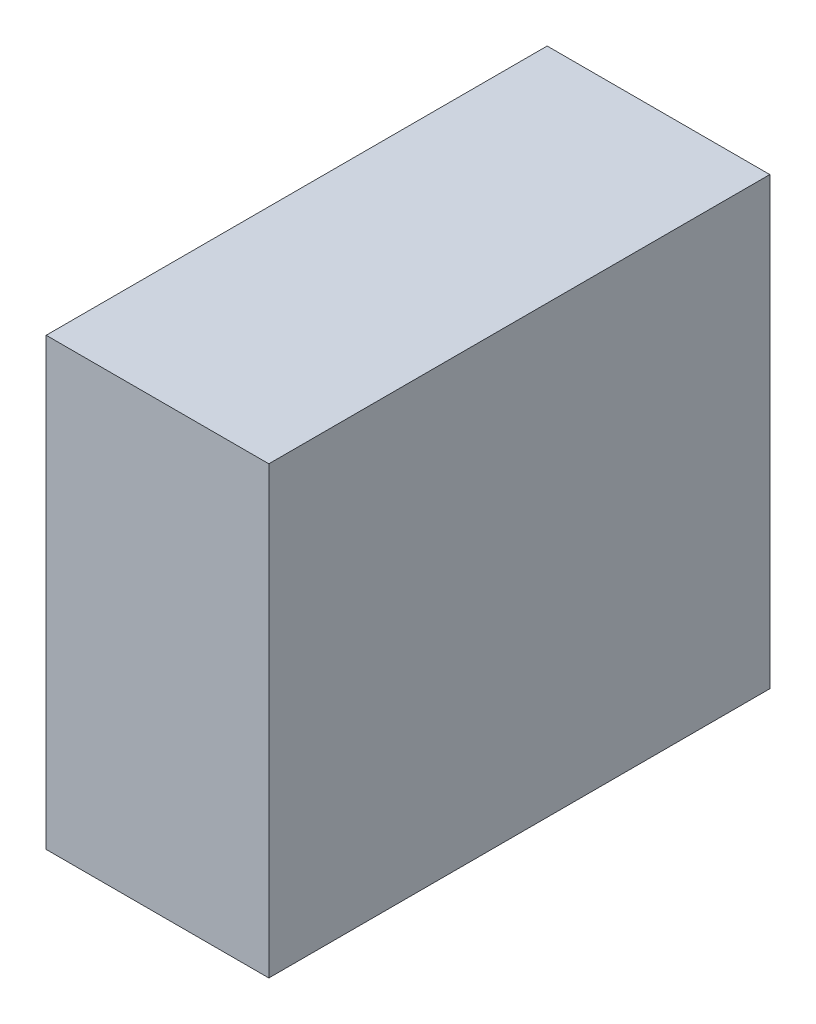
ISO-10303-21;
HEADER;
FILE_DESCRIPTION(('STEP AP214'),'2;1');
FILE_NAME('part.step','',(''),(''),'','','');
FILE_SCHEMA(('AUTOMOTIVE_DESIGN { 1 0 10303 214 1 1 1 1 }'));
ENDSEC;
DATA;
#1=APPLICATION_CONTEXT('core data for automotive mechanical design processes');
#2=APPLICATION_PROTOCOL_DEFINITION('international standard','automotive_design',2000,#1);
#3=PRODUCT_CONTEXT('',#1,'mechanical');
#4=PRODUCT('Part','Part','',(#3));
#5=PRODUCT_RELATED_PRODUCT_CATEGORY('part','',(#4));
#6=PRODUCT_DEFINITION_FORMATION('','',#4);
#7=PRODUCT_DEFINITION_CONTEXT('part definition',#1,'design');
#8=PRODUCT_DEFINITION('design','',#6,#7);
#9=PRODUCT_DEFINITION_SHAPE('','',#8);
#10=(LENGTH_UNIT() NAMED_UNIT(*) SI_UNIT(.MILLI.,.METRE.));
#11=(NAMED_UNIT(*) PLANE_ANGLE_UNIT() SI_UNIT($,.RADIAN.));
#12=(NAMED_UNIT(*) SI_UNIT($,.STERADIAN.) SOLID_ANGLE_UNIT());
#13=UNCERTAINTY_MEASURE_WITH_UNIT(LENGTH_MEASURE(1.E-05),#10,'distance_accuracy_value','');
#14=(GEOMETRIC_REPRESENTATION_CONTEXT(3) GLOBAL_UNCERTAINTY_ASSIGNED_CONTEXT((#13)) GLOBAL_UNIT_ASSIGNED_CONTEXT((#10,
#11,#12)) REPRESENTATION_CONTEXT('',''));
#15=CARTESIAN_POINT('',(0.,0.,0.));
#16=DIRECTION('',(0.,0.,1.));
#17=DIRECTION('',(1.,0.,0.));
#18=AXIS2_PLACEMENT_3D('',#15,#16,#17);
#19=CARTESIAN_POINT('',(0.1999996,-0.3999992,0.));
#20=DIRECTION('',(-1.,0.,0.));
#21=DIRECTION('',(0.,0.,1.));
#22=AXIS2_PLACEMENT_3D('',#19,#20,#21);
#23=PLANE('',#22);
#24=DIRECTION('',(0.,0.,-1.));
#25=VECTOR('',#24,1.);
#26=CARTESIAN_POINT('',(0.1999996,0.3999992,0.));
#27=LINE('',#26,#25);
#28=CARTESIAN_POINT('',(0.1999996,0.3999992,0.));
#29=VERTEX_POINT('',#28);
#30=CARTESIAN_POINT('',(0.1999996,0.3999992,0.90000074));
#31=VERTEX_POINT('',#30);
#32=EDGE_CURVE('E20',#29,#31,#27,.F.);
#33=ORIENTED_EDGE('',*,*,#32,.T.);
#34=DIRECTION('',(0.,1.,0.));
#35=VECTOR('',#34,1.);
#36=CARTESIAN_POINT('',(0.1999996,0.3999992,0.90000074));
#37=LINE('',#36,#35);
#38=CARTESIAN_POINT('',(0.1999996,-0.3999992,0.90000074));
#39=VERTEX_POINT('',#38);
#40=EDGE_CURVE('E55',#31,#39,#37,.F.);
#41=ORIENTED_EDGE('',*,*,#40,.T.);
#42=DIRECTION('',(0.,0.,1.));
#43=VECTOR('',#42,1.);
#44=CARTESIAN_POINT('',(0.1999996,-0.3999992,0.));
#45=LINE('',#44,#43);
#46=CARTESIAN_POINT('',(0.1999996,-0.3999992,0.));
#47=VERTEX_POINT('',#46);
#48=EDGE_CURVE('E76',#39,#47,#45,.F.);
#49=ORIENTED_EDGE('',*,*,#48,.T.);
#50=DIRECTION('',(0.,1.,0.));
#51=VECTOR('',#50,1.);
#52=CARTESIAN_POINT('',(0.1999996,0.3999992,0.));
#53=LINE('',#52,#51);
#54=EDGE_CURVE('E58',#29,#47,#53,.F.);
#55=ORIENTED_EDGE('',*,*,#54,.F.);
#56=EDGE_LOOP('',(#33,#41,#49,#55));
#57=FACE_BOUND('',#56,.T.);
#58=ADVANCED_FACE('F17',(#57),#23,.F.);
#59=CARTESIAN_POINT('',(0.1999996,0.3999992,0.));
#60=DIRECTION('',(0.,-1.,0.));
#61=DIRECTION('',(0.,0.,-1.));
#62=AXIS2_PLACEMENT_3D('',#59,#60,#61);
#63=PLANE('',#62);
#64=DIRECTION('',(0.,0.,-1.));
#65=VECTOR('',#64,1.);
#66=CARTESIAN_POINT('',(-0.1999996,0.3999992,0.));
#67=LINE('',#66,#65);
#68=CARTESIAN_POINT('',(-0.1999996,0.3999992,0.));
#69=VERTEX_POINT('',#68);
#70=CARTESIAN_POINT('',(-0.1999996,0.3999992,0.90000074));
#71=VERTEX_POINT('',#70);
#72=EDGE_CURVE('E73',#69,#71,#67,.F.);
#73=ORIENTED_EDGE('',*,*,#72,.T.);
#74=DIRECTION('',(-1.,0.,0.));
#75=VECTOR('',#74,1.);
#76=CARTESIAN_POINT('',(-0.1999996,0.3999992,0.90000074));
#77=LINE('',#76,#75);
#78=EDGE_CURVE('E63',#71,#31,#77,.F.);
#79=ORIENTED_EDGE('',*,*,#78,.T.);
#80=ORIENTED_EDGE('',*,*,#32,.F.);
#81=DIRECTION('',(-1.,0.,0.));
#82=VECTOR('',#81,1.);
#83=CARTESIAN_POINT('',(-0.1999996,0.3999992,0.));
#84=LINE('',#83,#82);
#85=EDGE_CURVE('E78',#69,#29,#84,.F.);
#86=ORIENTED_EDGE('',*,*,#85,.F.);
#87=EDGE_LOOP('',(#73,#79,#80,#86));
#88=FACE_BOUND('',#87,.T.);
#89=ADVANCED_FACE('F72',(#88),#63,.F.);
#90=CARTESIAN_POINT('',(-0.1999996,0.3999992,0.90000074));
#91=DIRECTION('',(0.,0.,-1.));
#92=DIRECTION('',(-1.,0.,0.));
#93=AXIS2_PLACEMENT_3D('',#90,#91,#92);
#94=PLANE('',#93);
#95=DIRECTION('',(1.,0.,0.));
#96=VECTOR('',#95,1.);
#97=CARTESIAN_POINT('',(-0.1999996,-0.3999992,0.90000074));
#98=LINE('',#97,#96);
#99=CARTESIAN_POINT('',(-0.1999996,-0.3999992,0.90000074));
#100=VERTEX_POINT('',#99);
#101=EDGE_CURVE('E69',#100,#39,#98,.T.);
#102=ORIENTED_EDGE('',*,*,#101,.T.);
#103=ORIENTED_EDGE('',*,*,#40,.F.);
#104=ORIENTED_EDGE('',*,*,#78,.F.);
#105=DIRECTION('',(0.,1.,0.));
#106=VECTOR('',#105,1.);
#107=CARTESIAN_POINT('',(-0.1999996,0.3999992,0.90000074));
#108=LINE('',#107,#106);
#109=EDGE_CURVE('E83',#71,#100,#108,.F.);
#110=ORIENTED_EDGE('',*,*,#109,.T.);
#111=EDGE_LOOP('',(#102,#103,#104,#110));
#112=FACE_BOUND('',#111,.T.);
#113=ADVANCED_FACE('F66',(#112),#94,.F.);
#114=CARTESIAN_POINT('',(-0.1999996,-0.3999992,0.));
#115=DIRECTION('',(0.,1.,0.));
#116=DIRECTION('',(0.,0.,1.));
#117=AXIS2_PLACEMENT_3D('',#114,#115,#116);
#118=PLANE('',#117);
#119=ORIENTED_EDGE('',*,*,#48,.F.);
#120=ORIENTED_EDGE('',*,*,#101,.F.);
#121=DIRECTION('',(0.,0.,-1.));
#122=VECTOR('',#121,1.);
#123=CARTESIAN_POINT('',(-0.1999996,-0.3999992,0.));
#124=LINE('',#123,#122);
#125=CARTESIAN_POINT('',(-0.1999996,-0.3999992,0.));
#126=VERTEX_POINT('',#125);
#127=EDGE_CURVE('E26',#100,#126,#124,.T.);
#128=ORIENTED_EDGE('',*,*,#127,.T.);
#129=DIRECTION('',(-1.,0.,0.));
#130=VECTOR('',#129,1.);
#131=CARTESIAN_POINT('',(-0.1999996,-0.3999992,0.));
#132=LINE('',#131,#130);
#133=EDGE_CURVE('E34',#47,#126,#132,.T.);
#134=ORIENTED_EDGE('',*,*,#133,.F.);
#135=EDGE_LOOP('',(#119,#120,#128,#134));
#136=FACE_BOUND('',#135,.T.);
#137=ADVANCED_FACE('F88',(#136),#118,.F.);
#138=CARTESIAN_POINT('',(-0.1999996,0.3999992,0.));
#139=DIRECTION('',(0.,0.,-1.));
#140=DIRECTION('',(-1.,0.,0.));
#141=AXIS2_PLACEMENT_3D('',#138,#139,#140);
#142=PLANE('',#141);
#143=ORIENTED_EDGE('',*,*,#133,.T.);
#144=DIRECTION('',(0.,1.,0.));
#145=VECTOR('',#144,1.);
#146=CARTESIAN_POINT('',(-0.1999996,0.3999992,0.));
#147=LINE('',#146,#145);
#148=EDGE_CURVE('E11',#126,#69,#147,.T.);
#149=ORIENTED_EDGE('',*,*,#148,.T.);
#150=ORIENTED_EDGE('',*,*,#85,.T.);
#151=ORIENTED_EDGE('',*,*,#54,.T.);
#152=EDGE_LOOP('',(#143,#149,#150,#151));
#153=FACE_BOUND('',#152,.T.);
#154=ADVANCED_FACE('F91',(#153),#142,.T.);
#155=CARTESIAN_POINT('',(-0.1999996,0.3999992,0.));
#156=DIRECTION('',(1.,0.,0.));
#157=DIRECTION('',(0.,0.,-1.));
#158=AXIS2_PLACEMENT_3D('',#155,#156,#157);
#159=PLANE('',#158);
#160=ORIENTED_EDGE('',*,*,#127,.F.);
#161=ORIENTED_EDGE('',*,*,#109,.F.);
#162=ORIENTED_EDGE('',*,*,#72,.F.);
#163=ORIENTED_EDGE('',*,*,#148,.F.);
#164=EDGE_LOOP('',(#160,#161,#162,#163));
#165=FACE_BOUND('',#164,.T.);
#166=ADVANCED_FACE('F90',(#165),#159,.F.);
#167=CLOSED_SHELL('',(#58,#89,#113,#137,#154,#166));
#168=MANIFOLD_SOLID_BREP('B1',#167);
#169=ADVANCED_BREP_SHAPE_REPRESENTATION('',(#18,#168),#14);
#170=SHAPE_DEFINITION_REPRESENTATION(#9,#169);
ENDSEC;
END-ISO-10303-21;
